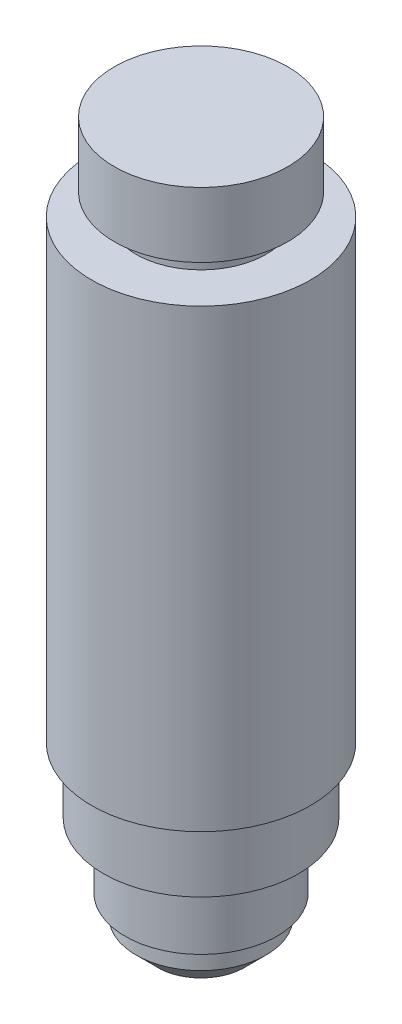
ISO-10303-21;
HEADER;
FILE_DESCRIPTION(('STEP AP214'),'2;1');
FILE_NAME('part.step','',(''),(''),'','','');
FILE_SCHEMA(('AUTOMOTIVE_DESIGN { 1 0 10303 214 1 1 1 1 }'));
ENDSEC;
DATA;
#1=APPLICATION_CONTEXT('core data for automotive mechanical design processes');
#2=APPLICATION_PROTOCOL_DEFINITION('international standard','automotive_design',2000,#1);
#3=PRODUCT_CONTEXT('',#1,'mechanical');
#4=PRODUCT('Part','Part','',(#3));
#5=PRODUCT_RELATED_PRODUCT_CATEGORY('part','',(#4));
#6=PRODUCT_DEFINITION_FORMATION('','',#4);
#7=PRODUCT_DEFINITION_CONTEXT('part definition',#1,'design');
#8=PRODUCT_DEFINITION('design','',#6,#7);
#9=PRODUCT_DEFINITION_SHAPE('','',#8);
#10=(LENGTH_UNIT() NAMED_UNIT(*) SI_UNIT(.MILLI.,.METRE.));
#11=(NAMED_UNIT(*) PLANE_ANGLE_UNIT() SI_UNIT($,.RADIAN.));
#12=(NAMED_UNIT(*) SI_UNIT($,.STERADIAN.) SOLID_ANGLE_UNIT());
#13=UNCERTAINTY_MEASURE_WITH_UNIT(LENGTH_MEASURE(1.E-05),#10,'distance_accuracy_value','');
#14=(GEOMETRIC_REPRESENTATION_CONTEXT(3) GLOBAL_UNCERTAINTY_ASSIGNED_CONTEXT((#13)) GLOBAL_UNIT_ASSIGNED_CONTEXT((#10,
#11,#12)) REPRESENTATION_CONTEXT('',''));
#15=CARTESIAN_POINT('',(0.,0.,0.));
#16=DIRECTION('',(0.,0.,1.));
#17=DIRECTION('',(1.,0.,0.));
#18=AXIS2_PLACEMENT_3D('',#15,#16,#17);
#19=CARTESIAN_POINT('',(12.827,20.32,0.));
#20=DIRECTION('',(0.,-1.,0.));
#21=DIRECTION('',(0.,0.,-1.));
#22=AXIS2_PLACEMENT_3D('',#19,#20,#21);
#23=PLANE('',#22);
#24=CARTESIAN_POINT('',(0.,20.32,0.));
#25=DIRECTION('',(0.,-1.,0.));
#26=DIRECTION('',(0.,0.,-1.));
#27=AXIS2_PLACEMENT_3D('',#24,#25,#26);
#28=CIRCLE('',#27,12.827);
#29=CARTESIAN_POINT('',(0.,20.32,-12.827));
#30=VERTEX_POINT('',#29);
#31=EDGE_CURVE('E10',#30,#30,#28,.T.);
#32=ORIENTED_EDGE('',*,*,#31,.T.);
#33=EDGE_LOOP('',(#32));
#34=FACE_BOUND('',#33,.T.);
#35=CARTESIAN_POINT('',(0.,20.32,0.));
#36=DIRECTION('',(0.,-1.,0.));
#37=DIRECTION('',(0.,0.,-1.));
#38=AXIS2_PLACEMENT_3D('',#35,#36,#37);
#39=CIRCLE('',#38,11.43);
#40=CARTESIAN_POINT('',(0.,20.32,-11.43));
#41=VERTEX_POINT('',#40);
#42=EDGE_CURVE('E94',#41,#41,#39,.T.);
#43=ORIENTED_EDGE('',*,*,#42,.F.);
#44=EDGE_LOOP('',(#43));
#45=FACE_BOUND('',#44,.T.);
#46=ADVANCED_FACE('F35',(#34,#45),#23,.T.);
#47=CARTESIAN_POINT('',(0.,0.,0.));
#48=DIRECTION('',(0.,-1.,0.));
#49=DIRECTION('',(0.,0.,-1.));
#50=AXIS2_PLACEMENT_3D('',#47,#48,#49);
#51=CYLINDRICAL_SURFACE('',#50,12.827);
#52=CARTESIAN_POINT('',(0.,73.66,0.));
#53=DIRECTION('',(0.,-1.,0.));
#54=DIRECTION('',(0.,0.,-1.));
#55=AXIS2_PLACEMENT_3D('',#52,#53,#54);
#56=CIRCLE('',#55,12.827);
#57=CARTESIAN_POINT('',(0.,73.66,-12.827));
#58=VERTEX_POINT('',#57);
#59=EDGE_CURVE('E43',#58,#58,#56,.T.);
#60=ORIENTED_EDGE('',*,*,#59,.T.);
#61=EDGE_LOOP('',(#60));
#62=FACE_BOUND('',#61,.T.);
#63=ORIENTED_EDGE('',*,*,#31,.F.);
#64=EDGE_LOOP('',(#63));
#65=FACE_BOUND('',#64,.T.);
#66=ADVANCED_FACE('F102',(#62,#65),#51,.T.);
#67=CARTESIAN_POINT('',(7.62,73.66,0.));
#68=DIRECTION('',(0.,1.,0.));
#69=DIRECTION('',(0.,0.,1.));
#70=AXIS2_PLACEMENT_3D('',#67,#68,#69);
#71=PLANE('',#70);
#72=CARTESIAN_POINT('',(0.,73.66,0.));
#73=DIRECTION('',(0.,-1.,0.));
#74=DIRECTION('',(0.,0.,-1.));
#75=AXIS2_PLACEMENT_3D('',#72,#73,#74);
#76=CIRCLE('',#75,7.62);
#77=CARTESIAN_POINT('',(0.,73.66,-7.62));
#78=VERTEX_POINT('',#77);
#79=EDGE_CURVE('E49',#78,#78,#76,.T.);
#80=ORIENTED_EDGE('',*,*,#79,.T.);
#81=EDGE_LOOP('',(#80));
#82=FACE_BOUND('',#81,.T.);
#83=ORIENTED_EDGE('',*,*,#59,.F.);
#84=EDGE_LOOP('',(#83));
#85=FACE_BOUND('',#84,.T.);
#86=ADVANCED_FACE('F106',(#82,#85),#71,.T.);
#87=CARTESIAN_POINT('',(0.,0.,0.));
#88=DIRECTION('',(0.,-1.,0.));
#89=DIRECTION('',(0.,0.,-1.));
#90=AXIS2_PLACEMENT_3D('',#87,#88,#89);
#91=CYLINDRICAL_SURFACE('',#90,7.62);
#92=CARTESIAN_POINT('',(0.,76.2,0.));
#93=DIRECTION('',(0.,-1.,0.));
#94=DIRECTION('',(0.,0.,-1.));
#95=AXIS2_PLACEMENT_3D('',#92,#93,#94);
#96=CIRCLE('',#95,7.62);
#97=CARTESIAN_POINT('',(0.,76.2,-7.62));
#98=VERTEX_POINT('',#97);
#99=EDGE_CURVE('E53',#98,#98,#96,.T.);
#100=ORIENTED_EDGE('',*,*,#99,.T.);
#101=EDGE_LOOP('',(#100));
#102=FACE_BOUND('',#101,.T.);
#103=ORIENTED_EDGE('',*,*,#79,.F.);
#104=EDGE_LOOP('',(#103));
#105=FACE_BOUND('',#104,.T.);
#106=ADVANCED_FACE('F111',(#102,#105),#91,.T.);
#107=CARTESIAN_POINT('',(10.16,76.2,0.));
#108=DIRECTION('',(0.,-1.,0.));
#109=DIRECTION('',(0.,0.,-1.));
#110=AXIS2_PLACEMENT_3D('',#107,#108,#109);
#111=PLANE('',#110);
#112=CARTESIAN_POINT('',(0.,76.2,0.));
#113=DIRECTION('',(0.,-1.,0.));
#114=DIRECTION('',(0.,0.,-1.));
#115=AXIS2_PLACEMENT_3D('',#112,#113,#114);
#116=CIRCLE('',#115,10.16);
#117=CARTESIAN_POINT('',(0.,76.2,-10.16));
#118=VERTEX_POINT('',#117);
#119=EDGE_CURVE('E58',#118,#118,#116,.T.);
#120=ORIENTED_EDGE('',*,*,#119,.T.);
#121=EDGE_LOOP('',(#120));
#122=FACE_BOUND('',#121,.T.);
#123=ORIENTED_EDGE('',*,*,#99,.F.);
#124=EDGE_LOOP('',(#123));
#125=FACE_BOUND('',#124,.T.);
#126=ADVANCED_FACE('F115',(#122,#125),#111,.T.);
#127=CARTESIAN_POINT('',(0.,0.,0.));
#128=DIRECTION('',(0.,-1.,0.));
#129=DIRECTION('',(0.,0.,-1.));
#130=AXIS2_PLACEMENT_3D('',#127,#128,#129);
#131=CYLINDRICAL_SURFACE('',#130,10.16);
#132=CARTESIAN_POINT('',(0.,83.82,0.));
#133=DIRECTION('',(0.,-1.,0.));
#134=DIRECTION('',(0.,0.,-1.));
#135=AXIS2_PLACEMENT_3D('',#132,#133,#134);
#136=CIRCLE('',#135,10.16);
#137=CARTESIAN_POINT('',(0.,83.82,-10.16));
#138=VERTEX_POINT('',#137);
#139=EDGE_CURVE('E61',#138,#138,#136,.T.);
#140=ORIENTED_EDGE('',*,*,#139,.T.);
#141=EDGE_LOOP('',(#140));
#142=FACE_BOUND('',#141,.T.);
#143=ORIENTED_EDGE('',*,*,#119,.F.);
#144=EDGE_LOOP('',(#143));
#145=FACE_BOUND('',#144,.T.);
#146=ADVANCED_FACE('F119',(#142,#145),#131,.T.);
#147=CARTESIAN_POINT('',(0.,83.82,0.));
#148=DIRECTION('',(0.,1.,0.));
#149=DIRECTION('',(0.,0.,1.));
#150=AXIS2_PLACEMENT_3D('',#147,#148,#149);
#151=PLANE('',#150);
#152=ORIENTED_EDGE('',*,*,#139,.F.);
#153=EDGE_LOOP('',(#152));
#154=FACE_BOUND('',#153,.T.);
#155=ADVANCED_FACE('F123',(#154),#151,.T.);
#156=CARTESIAN_POINT('',(5.08,0.,0.));
#157=DIRECTION('',(0.,-1.,0.));
#158=DIRECTION('',(0.,0.,-1.));
#159=AXIS2_PLACEMENT_3D('',#156,#157,#158);
#160=PLANE('',#159);
#161=CARTESIAN_POINT('',(0.,0.,0.));
#162=DIRECTION('',(0.,-1.,0.));
#163=DIRECTION('',(0.,0.,-1.));
#164=AXIS2_PLACEMENT_3D('',#161,#162,#163);
#165=CIRCLE('',#164,5.08);
#166=CARTESIAN_POINT('',(0.,0.,-5.08));
#167=VERTEX_POINT('',#166);
#168=EDGE_CURVE('E64',#167,#167,#165,.T.);
#169=ORIENTED_EDGE('',*,*,#168,.T.);
#170=EDGE_LOOP('',(#169));
#171=FACE_BOUND('',#170,.T.);
#172=ADVANCED_FACE('F127',(#171),#160,.T.);
#173=CARTESIAN_POINT('',(0.,0.,0.));
#174=DIRECTION('',(0.,-1.,0.));
#175=DIRECTION('',(0.,0.,-1.));
#176=AXIS2_PLACEMENT_3D('',#173,#174,#175);
#177=CYLINDRICAL_SURFACE('',#176,7.62);
#178=CARTESIAN_POINT('',(0.,5.08,0.));
#179=DIRECTION('',(0.,-1.,0.));
#180=DIRECTION('',(0.,0.,-1.));
#181=AXIS2_PLACEMENT_3D('',#178,#179,#180);
#182=CIRCLE('',#181,7.62);
#183=CARTESIAN_POINT('',(0.,5.08,-7.62));
#184=VERTEX_POINT('',#183);
#185=EDGE_CURVE('E71',#184,#184,#182,.T.);
#186=ORIENTED_EDGE('',*,*,#185,.T.);
#187=EDGE_LOOP('',(#186));
#188=FACE_BOUND('',#187,.T.);
#189=CARTESIAN_POINT('',(0.,2.54,0.));
#190=DIRECTION('',(0.,-1.,0.));
#191=DIRECTION('',(0.,0.,-1.));
#192=AXIS2_PLACEMENT_3D('',#189,#190,#191);
#193=CIRCLE('',#192,7.62);
#194=CARTESIAN_POINT('',(0.,2.54,-7.62));
#195=VERTEX_POINT('',#194);
#196=EDGE_CURVE('E67',#195,#195,#193,.T.);
#197=ORIENTED_EDGE('',*,*,#196,.F.);
#198=EDGE_LOOP('',(#197));
#199=FACE_BOUND('',#198,.T.);
#200=ADVANCED_FACE('F131',(#188,#199),#177,.T.);
#201=CARTESIAN_POINT('',(8.89,5.08,0.));
#202=DIRECTION('',(0.,-1.,0.));
#203=DIRECTION('',(0.,0.,-1.));
#204=AXIS2_PLACEMENT_3D('',#201,#202,#203);
#205=PLANE('',#204);
#206=CARTESIAN_POINT('',(0.,5.08,0.));
#207=DIRECTION('',(0.,-1.,0.));
#208=DIRECTION('',(0.,0.,-1.));
#209=AXIS2_PLACEMENT_3D('',#206,#207,#208);
#210=CIRCLE('',#209,8.89);
#211=CARTESIAN_POINT('',(0.,5.08,-8.89));
#212=VERTEX_POINT('',#211);
#213=EDGE_CURVE('E75',#212,#212,#210,.T.);
#214=ORIENTED_EDGE('',*,*,#213,.T.);
#215=EDGE_LOOP('',(#214));
#216=FACE_BOUND('',#215,.T.);
#217=ORIENTED_EDGE('',*,*,#185,.F.);
#218=EDGE_LOOP('',(#217));
#219=FACE_BOUND('',#218,.T.);
#220=ADVANCED_FACE('F135',(#216,#219),#205,.T.);
#221=CARTESIAN_POINT('',(0.,0.,0.));
#222=DIRECTION('',(0.,-1.,0.));
#223=DIRECTION('',(0.,0.,-1.));
#224=AXIS2_PLACEMENT_3D('',#221,#222,#223);
#225=CYLINDRICAL_SURFACE('',#224,8.89);
#226=CARTESIAN_POINT('',(0.,11.43,0.));
#227=DIRECTION('',(0.,-1.,0.));
#228=DIRECTION('',(0.,0.,-1.));
#229=AXIS2_PLACEMENT_3D('',#226,#227,#228);
#230=CIRCLE('',#229,8.89);
#231=CARTESIAN_POINT('',(0.,11.43,-8.89));
#232=VERTEX_POINT('',#231);
#233=EDGE_CURVE('E79',#232,#232,#230,.T.);
#234=ORIENTED_EDGE('',*,*,#233,.T.);
#235=EDGE_LOOP('',(#234));
#236=FACE_BOUND('',#235,.T.);
#237=ORIENTED_EDGE('',*,*,#213,.F.);
#238=EDGE_LOOP('',(#237));
#239=FACE_BOUND('',#238,.T.);
#240=ADVANCED_FACE('F139',(#236,#239),#225,.T.);
#241=CARTESIAN_POINT('',(7.62,11.43,0.));
#242=DIRECTION('',(0.,1.,0.));
#243=DIRECTION('',(0.,0.,1.));
#244=AXIS2_PLACEMENT_3D('',#241,#242,#243);
#245=PLANE('',#244);
#246=CARTESIAN_POINT('',(0.,11.43,0.));
#247=DIRECTION('',(0.,-1.,0.));
#248=DIRECTION('',(0.,0.,-1.));
#249=AXIS2_PLACEMENT_3D('',#246,#247,#248);
#250=CIRCLE('',#249,7.62);
#251=CARTESIAN_POINT('',(0.,11.43,-7.62));
#252=VERTEX_POINT('',#251);
#253=EDGE_CURVE('E83',#252,#252,#250,.T.);
#254=ORIENTED_EDGE('',*,*,#253,.T.);
#255=EDGE_LOOP('',(#254));
#256=FACE_BOUND('',#255,.T.);
#257=ORIENTED_EDGE('',*,*,#233,.F.);
#258=EDGE_LOOP('',(#257));
#259=FACE_BOUND('',#258,.T.);
#260=ADVANCED_FACE('F143',(#256,#259),#245,.T.);
#261=CARTESIAN_POINT('',(0.,0.,0.));
#262=DIRECTION('',(0.,-1.,0.));
#263=DIRECTION('',(0.,0.,-1.));
#264=AXIS2_PLACEMENT_3D('',#261,#262,#263);
#265=CYLINDRICAL_SURFACE('',#264,7.62);
#266=CARTESIAN_POINT('',(0.,12.7,0.));
#267=DIRECTION('',(0.,-1.,0.));
#268=DIRECTION('',(0.,0.,-1.));
#269=AXIS2_PLACEMENT_3D('',#266,#267,#268);
#270=CIRCLE('',#269,7.62);
#271=CARTESIAN_POINT('',(0.,12.7,-7.62));
#272=VERTEX_POINT('',#271);
#273=EDGE_CURVE('E87',#272,#272,#270,.T.);
#274=ORIENTED_EDGE('',*,*,#273,.T.);
#275=EDGE_LOOP('',(#274));
#276=FACE_BOUND('',#275,.T.);
#277=ORIENTED_EDGE('',*,*,#253,.F.);
#278=EDGE_LOOP('',(#277));
#279=FACE_BOUND('',#278,.T.);
#280=ADVANCED_FACE('F147',(#276,#279),#265,.T.);
#281=CARTESIAN_POINT('',(11.43,12.7,0.));
#282=DIRECTION('',(0.,-1.,0.));
#283=DIRECTION('',(0.,0.,-1.));
#284=AXIS2_PLACEMENT_3D('',#281,#282,#283);
#285=PLANE('',#284);
#286=CARTESIAN_POINT('',(0.,12.7,0.));
#287=DIRECTION('',(0.,-1.,0.));
#288=DIRECTION('',(0.,0.,-1.));
#289=AXIS2_PLACEMENT_3D('',#286,#287,#288);
#290=CIRCLE('',#289,11.43);
#291=CARTESIAN_POINT('',(0.,12.7,-11.43));
#292=VERTEX_POINT('',#291);
#293=EDGE_CURVE('E91',#292,#292,#290,.T.);
#294=ORIENTED_EDGE('',*,*,#293,.T.);
#295=EDGE_LOOP('',(#294));
#296=FACE_BOUND('',#295,.T.);
#297=ORIENTED_EDGE('',*,*,#273,.F.);
#298=EDGE_LOOP('',(#297));
#299=FACE_BOUND('',#298,.T.);
#300=ADVANCED_FACE('F151',(#296,#299),#285,.T.);
#301=CARTESIAN_POINT('',(0.,0.,0.));
#302=DIRECTION('',(0.,-1.,0.));
#303=DIRECTION('',(0.,0.,-1.));
#304=AXIS2_PLACEMENT_3D('',#301,#302,#303);
#305=CYLINDRICAL_SURFACE('',#304,11.43);
#306=ORIENTED_EDGE('',*,*,#42,.T.);
#307=EDGE_LOOP('',(#306));
#308=FACE_BOUND('',#307,.T.);
#309=ORIENTED_EDGE('',*,*,#293,.F.);
#310=EDGE_LOOP('',(#309));
#311=FACE_BOUND('',#310,.T.);
#312=ADVANCED_FACE('F98',(#308,#311),#305,.T.);
#313=CARTESIAN_POINT('',(0.,0.,0.));
#314=DIRECTION('',(0.,1.,0.));
#315=DIRECTION('',(0.,0.,1.));
#316=AXIS2_PLACEMENT_3D('',#313,#314,#315);
#317=CONICAL_SURFACE('',#316,5.08,0.785398163397445);
#318=ORIENTED_EDGE('',*,*,#196,.T.);
#319=EDGE_LOOP('',(#318));
#320=FACE_BOUND('',#319,.T.);
#321=ORIENTED_EDGE('',*,*,#168,.F.);
#322=EDGE_LOOP('',(#321));
#323=FACE_BOUND('',#322,.T.);
#324=ADVANCED_FACE('F37',(#320,#323),#317,.T.);
#325=CLOSED_SHELL('',(#46,#66,#86,#106,#126,#146,#155,#172,#200,#220,#240,#260,#280,#300,#312,#324));
#326=MANIFOLD_SOLID_BREP('B2',#325);
#327=ADVANCED_BREP_SHAPE_REPRESENTATION('',(#18,#326),#14);
#328=SHAPE_DEFINITION_REPRESENTATION(#9,#327);
ENDSEC;
END-ISO-10303-21;
